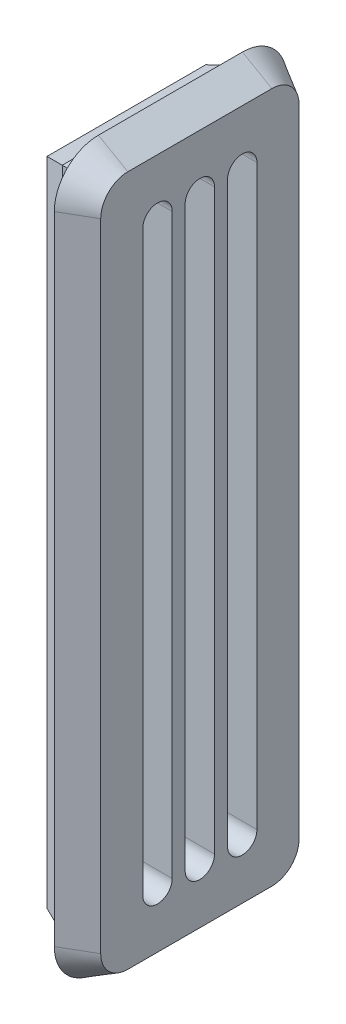
ISO-10303-21;
HEADER;
FILE_DESCRIPTION(('STEP AP214'),'2;1');
FILE_NAME('part.step','',(''),(''),'','','');
FILE_SCHEMA(('AUTOMOTIVE_DESIGN { 1 0 10303 214 1 1 1 1 }'));
ENDSEC;
DATA;
#1=APPLICATION_CONTEXT('core data for automotive mechanical design processes');
#2=APPLICATION_PROTOCOL_DEFINITION('international standard','automotive_design',2000,#1);
#3=PRODUCT_CONTEXT('',#1,'mechanical');
#4=PRODUCT('Part','Part','',(#3));
#5=PRODUCT_RELATED_PRODUCT_CATEGORY('part','',(#4));
#6=PRODUCT_DEFINITION_FORMATION('','',#4);
#7=PRODUCT_DEFINITION_CONTEXT('part definition',#1,'design');
#8=PRODUCT_DEFINITION('design','',#6,#7);
#9=PRODUCT_DEFINITION_SHAPE('','',#8);
#10=(LENGTH_UNIT() NAMED_UNIT(*) SI_UNIT(.MILLI.,.METRE.));
#11=(NAMED_UNIT(*) PLANE_ANGLE_UNIT() SI_UNIT($,.RADIAN.));
#12=(NAMED_UNIT(*) SI_UNIT($,.STERADIAN.) SOLID_ANGLE_UNIT());
#13=UNCERTAINTY_MEASURE_WITH_UNIT(LENGTH_MEASURE(1.E-05),#10,'distance_accuracy_value','');
#14=(GEOMETRIC_REPRESENTATION_CONTEXT(3) GLOBAL_UNCERTAINTY_ASSIGNED_CONTEXT((#13)) GLOBAL_UNIT_ASSIGNED_CONTEXT((#10,
#11,#12)) REPRESENTATION_CONTEXT('',''));
#15=CARTESIAN_POINT('',(0.,0.,0.));
#16=DIRECTION('',(0.,0.,1.));
#17=DIRECTION('',(1.,0.,0.));
#18=AXIS2_PLACEMENT_3D('',#15,#16,#17);
#19=CARTESIAN_POINT('',(0.,0.,0.));
#20=DIRECTION('',(1.,0.,0.));
#21=DIRECTION('',(0.,0.,-1.));
#22=AXIS2_PLACEMENT_3D('',#19,#20,#21);
#23=PLANE('',#22);
#24=DIRECTION('',(0.,1.,0.));
#25=VECTOR('',#24,1.);
#26=CARTESIAN_POINT('',(0.,0.,146.759181516781));
#27=LINE('',#26,#25);
#28=CARTESIAN_POINT('',(0.,22.7611561275582,146.759181516781));
#29=VERTEX_POINT('',#28);
#30=CARTESIAN_POINT('',(0.,67.0611561275582,146.759181516781));
#31=VERTEX_POINT('',#30);
#32=EDGE_CURVE('E461',#29,#31,#27,.T.);
#33=ORIENTED_EDGE('',*,*,#32,.T.);
#34=DIRECTION('',(0.,0.,-1.));
#35=VECTOR('',#34,1.);
#36=CARTESIAN_POINT('',(0.,67.0611561275582,0.));
#37=LINE('',#36,#35);
#38=CARTESIAN_POINT('',(0.,67.0611561275582,135.959181516781));
#39=VERTEX_POINT('',#38);
#40=EDGE_CURVE('E467',#31,#39,#37,.T.);
#41=ORIENTED_EDGE('',*,*,#40,.T.);
#42=DIRECTION('',(0.,-1.,0.));
#43=VECTOR('',#42,1.);
#44=CARTESIAN_POINT('',(0.,0.,135.959181516781));
#45=LINE('',#44,#43);
#46=CARTESIAN_POINT('',(0.,22.7611561275582,135.959181516781));
#47=VERTEX_POINT('',#46);
#48=EDGE_CURVE('E465',#39,#47,#45,.T.);
#49=ORIENTED_EDGE('',*,*,#48,.T.);
#50=DIRECTION('',(0.,0.,1.));
#51=VECTOR('',#50,1.);
#52=CARTESIAN_POINT('',(0.,22.7611561275583,0.));
#53=LINE('',#52,#51);
#54=EDGE_CURVE('E463',#47,#29,#53,.T.);
#55=ORIENTED_EDGE('',*,*,#54,.T.);
#56=EDGE_LOOP('',(#33,#41,#49,#55));
#57=FACE_BOUND('',#56,.T.);
#58=DIRECTION('',(0.,0.,1.));
#59=VECTOR('',#58,1.);
#60=CARTESIAN_POINT('',(0.,66.0611561275582,145.759181516781));
#61=LINE('',#60,#59);
#62=CARTESIAN_POINT('',(0.,66.0611561275582,136.959181516781));
#63=VERTEX_POINT('',#62);
#64=CARTESIAN_POINT('',(0.,66.0611561275582,145.759181516781));
#65=VERTEX_POINT('',#64);
#66=EDGE_CURVE('E366',#63,#65,#61,.T.);
#67=ORIENTED_EDGE('',*,*,#66,.T.);
#68=DIRECTION('',(0.,-1.,0.));
#69=VECTOR('',#68,1.);
#70=CARTESIAN_POINT('',(0.,66.0611561275582,145.759181516781));
#71=LINE('',#70,#69);
#72=CARTESIAN_POINT('',(0.,23.7611561275583,145.759181516781));
#73=VERTEX_POINT('',#72);
#74=EDGE_CURVE('E420',#65,#73,#71,.T.);
#75=ORIENTED_EDGE('',*,*,#74,.T.);
#76=DIRECTION('',(0.,0.,-1.));
#77=VECTOR('',#76,1.);
#78=CARTESIAN_POINT('',(0.,23.7611561275583,145.759181516781));
#79=LINE('',#78,#77);
#80=CARTESIAN_POINT('',(0.,23.7611561275582,136.959181516781));
#81=VERTEX_POINT('',#80);
#82=EDGE_CURVE('E423',#73,#81,#79,.T.);
#83=ORIENTED_EDGE('',*,*,#82,.T.);
#84=DIRECTION('',(0.,1.,0.));
#85=VECTOR('',#84,1.);
#86=CARTESIAN_POINT('',(0.,66.0611561275582,136.959181516781));
#87=LINE('',#86,#85);
#88=EDGE_CURVE('E408',#81,#63,#87,.T.);
#89=ORIENTED_EDGE('',*,*,#88,.T.);
#90=EDGE_LOOP('',(#67,#75,#83,#89));
#91=FACE_BOUND('',#90,.T.);
#92=ADVANCED_FACE('F41',(#57,#91),#23,.F.);
#93=CARTESIAN_POINT('',(3.,67.5611561275582,147.259181516781));
#94=DIRECTION('',(0.,0.,-1.));
#95=DIRECTION('',(-1.,0.,0.));
#96=AXIS2_PLACEMENT_3D('',#93,#94,#95);
#97=PLANE('',#96);
#98=DIRECTION('',(-1.,0.,0.));
#99=VECTOR('',#98,1.);
#100=CARTESIAN_POINT('',(3.,67.5611561275582,147.259181516781));
#101=LINE('',#100,#99);
#102=CARTESIAN_POINT('',(3.,67.5611561275582,147.259181516781));
#103=VERTEX_POINT('',#102);
#104=CARTESIAN_POINT('',(1.53884176858762,67.5611561275582,147.259181516781));
#105=VERTEX_POINT('',#104);
#106=EDGE_CURVE('E449',#103,#105,#101,.T.);
#107=ORIENTED_EDGE('',*,*,#106,.T.);
#108=DIRECTION('',(0.,-1.,0.));
#109=VECTOR('',#108,1.);
#110=CARTESIAN_POINT('',(1.53884176858762,67.5611561275582,147.259181516781));
#111=LINE('',#110,#109);
#112=CARTESIAN_POINT('',(1.53884176858762,22.2611561275582,147.259181516781));
#113=VERTEX_POINT('',#112);
#114=EDGE_CURVE('E11',#105,#113,#111,.T.);
#115=ORIENTED_EDGE('',*,*,#114,.T.);
#116=DIRECTION('',(-1.,0.,0.));
#117=VECTOR('',#116,1.);
#118=CARTESIAN_POINT('',(3.,22.2611561275582,147.259181516781));
#119=LINE('',#118,#117);
#120=CARTESIAN_POINT('',(3.,22.2611561275582,147.259181516781));
#121=VERTEX_POINT('',#120);
#122=EDGE_CURVE('E456',#121,#113,#119,.T.);
#123=ORIENTED_EDGE('',*,*,#122,.F.);
#124=DIRECTION('',(0.,-1.,0.));
#125=VECTOR('',#124,1.);
#126=CARTESIAN_POINT('',(3.,67.5611561275582,147.259181516781));
#127=LINE('',#126,#125);
#128=EDGE_CURVE('E437',#103,#121,#127,.T.);
#129=ORIENTED_EDGE('',*,*,#128,.F.);
#130=EDGE_LOOP('',(#107,#115,#123,#129));
#131=FACE_BOUND('',#130,.T.);
#132=ADVANCED_FACE('F502',(#131),#97,.F.);
#133=CARTESIAN_POINT('',(3.,22.2611561275582,147.259181516781));
#134=DIRECTION('',(0.,1.,0.));
#135=DIRECTION('',(0.,0.,1.));
#136=AXIS2_PLACEMENT_3D('',#133,#134,#135);
#137=PLANE('',#136);
#138=ORIENTED_EDGE('',*,*,#122,.T.);
#139=DIRECTION('',(0.,0.,-1.));
#140=VECTOR('',#139,1.);
#141=CARTESIAN_POINT('',(1.53884176858762,22.2611561275582,147.259181516781));
#142=LINE('',#141,#140);
#143=CARTESIAN_POINT('',(1.53884176858762,22.2611561275582,135.459181516781));
#144=VERTEX_POINT('',#143);
#145=EDGE_CURVE('E51',#113,#144,#142,.T.);
#146=ORIENTED_EDGE('',*,*,#145,.T.);
#147=DIRECTION('',(-1.,0.,0.));
#148=VECTOR('',#147,1.);
#149=CARTESIAN_POINT('',(3.,22.2611561275582,135.459181516781));
#150=LINE('',#149,#148);
#151=CARTESIAN_POINT('',(3.,22.2611561275582,135.459181516781));
#152=VERTEX_POINT('',#151);
#153=EDGE_CURVE('E454',#152,#144,#150,.T.);
#154=ORIENTED_EDGE('',*,*,#153,.F.);
#155=DIRECTION('',(0.,0.,-1.));
#156=VECTOR('',#155,1.);
#157=CARTESIAN_POINT('',(3.,22.2611561275582,147.259181516781));
#158=LINE('',#157,#156);
#159=EDGE_CURVE('E440',#121,#152,#158,.T.);
#160=ORIENTED_EDGE('',*,*,#159,.F.);
#161=EDGE_LOOP('',(#138,#146,#154,#160));
#162=FACE_BOUND('',#161,.T.);
#163=ADVANCED_FACE('F509',(#162),#137,.F.);
#164=CARTESIAN_POINT('',(3.,67.5611561275582,135.459181516781));
#165=DIRECTION('',(0.,0.,1.));
#166=DIRECTION('',(1.,0.,0.));
#167=AXIS2_PLACEMENT_3D('',#164,#165,#166);
#168=PLANE('',#167);
#169=ORIENTED_EDGE('',*,*,#153,.T.);
#170=DIRECTION('',(0.,1.,0.));
#171=VECTOR('',#170,1.);
#172=CARTESIAN_POINT('',(1.53884176858762,67.5611561275582,135.459181516781));
#173=LINE('',#172,#171);
#174=CARTESIAN_POINT('',(1.53884176858762,67.5611561275582,135.459181516781));
#175=VERTEX_POINT('',#174);
#176=EDGE_CURVE('E470',#144,#175,#173,.T.);
#177=ORIENTED_EDGE('',*,*,#176,.T.);
#178=DIRECTION('',(-1.,0.,0.));
#179=VECTOR('',#178,1.);
#180=CARTESIAN_POINT('',(3.,67.5611561275582,135.459181516781));
#181=LINE('',#180,#179);
#182=CARTESIAN_POINT('',(3.,67.5611561275582,135.459181516781));
#183=VERTEX_POINT('',#182);
#184=EDGE_CURVE('E451',#183,#175,#181,.T.);
#185=ORIENTED_EDGE('',*,*,#184,.F.);
#186=DIRECTION('',(0.,1.,0.));
#187=VECTOR('',#186,1.);
#188=CARTESIAN_POINT('',(3.,67.5611561275582,135.459181516781));
#189=LINE('',#188,#187);
#190=EDGE_CURVE('E443',#152,#183,#189,.T.);
#191=ORIENTED_EDGE('',*,*,#190,.F.);
#192=EDGE_LOOP('',(#169,#177,#185,#191));
#193=FACE_BOUND('',#192,.T.);
#194=ADVANCED_FACE('F508',(#193),#168,.F.);
#195=CARTESIAN_POINT('',(3.,67.5611561275582,147.259181516781));
#196=DIRECTION('',(0.,-1.,0.));
#197=DIRECTION('',(0.,0.,-1.));
#198=AXIS2_PLACEMENT_3D('',#195,#196,#197);
#199=PLANE('',#198);
#200=ORIENTED_EDGE('',*,*,#184,.T.);
#201=DIRECTION('',(0.,0.,1.));
#202=VECTOR('',#201,1.);
#203=CARTESIAN_POINT('',(1.53884176858762,67.5611561275582,147.259181516781));
#204=LINE('',#203,#202);
#205=EDGE_CURVE('E458',#175,#105,#204,.T.);
#206=ORIENTED_EDGE('',*,*,#205,.T.);
#207=ORIENTED_EDGE('',*,*,#106,.F.);
#208=DIRECTION('',(0.,0.,1.));
#209=VECTOR('',#208,1.);
#210=CARTESIAN_POINT('',(3.,67.5611561275582,147.259181516781));
#211=LINE('',#210,#209);
#212=EDGE_CURVE('E446',#183,#103,#211,.T.);
#213=ORIENTED_EDGE('',*,*,#212,.F.);
#214=EDGE_LOOP('',(#200,#206,#207,#213));
#215=FACE_BOUND('',#214,.T.);
#216=ADVANCED_FACE('F500',(#215),#199,.F.);
#217=CARTESIAN_POINT('',(3.,66.0611561275582,145.759181516781));
#218=DIRECTION('',(0.,-1.,0.));
#219=DIRECTION('',(0.,0.,-1.));
#220=AXIS2_PLACEMENT_3D('',#217,#218,#219);
#221=PLANE('',#220);
#222=ORIENTED_EDGE('',*,*,#66,.F.);
#223=DIRECTION('',(-1.,0.,0.));
#224=VECTOR('',#223,1.);
#225=CARTESIAN_POINT('',(3.,66.0611561275582,136.959181516781));
#226=LINE('',#225,#224);
#227=CARTESIAN_POINT('',(3.,66.0611561275582,136.959181516781));
#228=VERTEX_POINT('',#227);
#229=EDGE_CURVE('E417',#228,#63,#226,.T.);
#230=ORIENTED_EDGE('',*,*,#229,.F.);
#231=DIRECTION('',(0.,0.,1.));
#232=VECTOR('',#231,1.);
#233=CARTESIAN_POINT('',(3.,66.0611561275582,145.759181516781));
#234=LINE('',#233,#232);
#235=CARTESIAN_POINT('',(3.,66.0611561275582,145.759181516781));
#236=VERTEX_POINT('',#235);
#237=EDGE_CURVE('E404',#228,#236,#234,.T.);
#238=ORIENTED_EDGE('',*,*,#237,.T.);
#239=DIRECTION('',(-1.,0.,0.));
#240=VECTOR('',#239,1.);
#241=CARTESIAN_POINT('',(3.,66.0611561275582,145.759181516781));
#242=LINE('',#241,#240);
#243=EDGE_CURVE('E434',#236,#65,#242,.T.);
#244=ORIENTED_EDGE('',*,*,#243,.T.);
#245=EDGE_LOOP('',(#222,#230,#238,#244));
#246=FACE_BOUND('',#245,.T.);
#247=ADVANCED_FACE('F524',(#246),#221,.T.);
#248=CARTESIAN_POINT('',(3.,66.0611561275582,145.759181516781));
#249=DIRECTION('',(0.,0.,-1.));
#250=DIRECTION('',(-1.,0.,0.));
#251=AXIS2_PLACEMENT_3D('',#248,#249,#250);
#252=PLANE('',#251);
#253=ORIENTED_EDGE('',*,*,#74,.F.);
#254=ORIENTED_EDGE('',*,*,#243,.F.);
#255=DIRECTION('',(0.,-1.,0.));
#256=VECTOR('',#255,1.);
#257=CARTESIAN_POINT('',(3.,66.0611561275582,145.759181516781));
#258=LINE('',#257,#256);
#259=CARTESIAN_POINT('',(3.,23.7611561275583,145.759181516781));
#260=VERTEX_POINT('',#259);
#261=EDGE_CURVE('E407',#236,#260,#258,.T.);
#262=ORIENTED_EDGE('',*,*,#261,.T.);
#263=DIRECTION('',(-1.,0.,0.));
#264=VECTOR('',#263,1.);
#265=CARTESIAN_POINT('',(3.,23.7611561275583,145.759181516781));
#266=LINE('',#265,#264);
#267=EDGE_CURVE('E432',#260,#73,#266,.T.);
#268=ORIENTED_EDGE('',*,*,#267,.T.);
#269=EDGE_LOOP('',(#253,#254,#262,#268));
#270=FACE_BOUND('',#269,.T.);
#271=ADVANCED_FACE('F530',(#270),#252,.T.);
#272=CARTESIAN_POINT('',(3.,23.7611561275583,145.759181516781));
#273=DIRECTION('',(0.,1.,0.));
#274=DIRECTION('',(0.,0.,1.));
#275=AXIS2_PLACEMENT_3D('',#272,#273,#274);
#276=PLANE('',#275);
#277=ORIENTED_EDGE('',*,*,#82,.F.);
#278=ORIENTED_EDGE('',*,*,#267,.F.);
#279=DIRECTION('',(0.,0.,-1.));
#280=VECTOR('',#279,1.);
#281=CARTESIAN_POINT('',(3.,23.7611561275583,145.759181516781));
#282=LINE('',#281,#280);
#283=CARTESIAN_POINT('',(3.,23.7611561275582,136.959181516781));
#284=VERTEX_POINT('',#283);
#285=EDGE_CURVE('E411',#260,#284,#282,.T.);
#286=ORIENTED_EDGE('',*,*,#285,.T.);
#287=DIRECTION('',(-1.,0.,0.));
#288=VECTOR('',#287,1.);
#289=CARTESIAN_POINT('',(3.,23.7611561275582,136.959181516781));
#290=LINE('',#289,#288);
#291=EDGE_CURVE('E430',#284,#81,#290,.T.);
#292=ORIENTED_EDGE('',*,*,#291,.T.);
#293=EDGE_LOOP('',(#277,#278,#286,#292));
#294=FACE_BOUND('',#293,.T.);
#295=ADVANCED_FACE('F535',(#294),#276,.T.);
#296=CARTESIAN_POINT('',(3.,66.0611561275582,136.959181516781));
#297=DIRECTION('',(0.,0.,1.));
#298=DIRECTION('',(1.,0.,0.));
#299=AXIS2_PLACEMENT_3D('',#296,#297,#298);
#300=PLANE('',#299);
#301=ORIENTED_EDGE('',*,*,#88,.F.);
#302=ORIENTED_EDGE('',*,*,#291,.F.);
#303=DIRECTION('',(0.,1.,0.));
#304=VECTOR('',#303,1.);
#305=CARTESIAN_POINT('',(3.,66.0611561275582,136.959181516781));
#306=LINE('',#305,#304);
#307=EDGE_CURVE('E414',#284,#228,#306,.T.);
#308=ORIENTED_EDGE('',*,*,#307,.T.);
#309=ORIENTED_EDGE('',*,*,#229,.T.);
#310=EDGE_LOOP('',(#301,#302,#308,#309));
#311=FACE_BOUND('',#310,.T.);
#312=ADVANCED_FACE('F541',(#311),#300,.T.);
#313=CARTESIAN_POINT('',(3.,66.5611561275582,136.459181516781));
#314=DIRECTION('',(-1.,0.,0.));
#315=DIRECTION('',(0.,0.,1.));
#316=AXIS2_PLACEMENT_3D('',#313,#314,#315);
#317=PLANE('',#316);
#318=CARTESIAN_POINT('',(3.,64.5611561275582,141.359181516781));
#319=DIRECTION('',(-1.,0.,0.));
#320=DIRECTION('',(0.,0.,1.));
#321=AXIS2_PLACEMENT_3D('',#318,#319,#320);
#322=CIRCLE('',#321,1.00000000000003);
#323=CARTESIAN_POINT('',(3.,64.5611561275582,142.359181516781));
#324=VERTEX_POINT('',#323);
#325=CARTESIAN_POINT('',(3.,64.5611561275582,140.359181516781));
#326=VERTEX_POINT('',#325);
#327=EDGE_CURVE('E305',#324,#326,#322,.T.);
#328=ORIENTED_EDGE('',*,*,#327,.F.);
#329=DIRECTION('',(0.,1.,0.));
#330=VECTOR('',#329,1.);
#331=CARTESIAN_POINT('',(3.,64.5611561275582,142.359181516781));
#332=LINE('',#331,#330);
#333=CARTESIAN_POINT('',(3.,25.2611561275582,142.359181516781));
#334=VERTEX_POINT('',#333);
#335=EDGE_CURVE('E291',#334,#324,#332,.T.);
#336=ORIENTED_EDGE('',*,*,#335,.F.);
#337=CARTESIAN_POINT('',(3.,25.2611561275582,141.359181516781));
#338=DIRECTION('',(-1.,0.,0.));
#339=DIRECTION('',(0.,0.,1.));
#340=AXIS2_PLACEMENT_3D('',#337,#338,#339);
#341=CIRCLE('',#340,1.00000000000003);
#342=CARTESIAN_POINT('',(3.,25.2611561275582,140.359181516781));
#343=VERTEX_POINT('',#342);
#344=EDGE_CURVE('E300',#343,#334,#341,.T.);
#345=ORIENTED_EDGE('',*,*,#344,.F.);
#346=DIRECTION('',(0.,-1.,0.));
#347=VECTOR('',#346,1.);
#348=CARTESIAN_POINT('',(3.,64.5611561275582,140.359181516781));
#349=LINE('',#348,#347);
#350=EDGE_CURVE('E302',#326,#343,#349,.T.);
#351=ORIENTED_EDGE('',*,*,#350,.F.);
#352=EDGE_LOOP('',(#328,#336,#345,#351));
#353=FACE_BOUND('',#352,.T.);
#354=CARTESIAN_POINT('',(3.,64.5611561275582,144.241468337996));
#355=DIRECTION('',(-1.,0.,0.));
#356=DIRECTION('',(0.,0.,1.));
#357=AXIS2_PLACEMENT_3D('',#354,#355,#356);
#358=CIRCLE('',#357,0.999999999999973);
#359=CARTESIAN_POINT('',(3.,64.5611561275582,145.241468337996));
#360=VERTEX_POINT('',#359);
#361=CARTESIAN_POINT('',(3.,64.5611561275582,143.241468337996));
#362=VERTEX_POINT('',#361);
#363=EDGE_CURVE('E247',#360,#362,#358,.T.);
#364=ORIENTED_EDGE('',*,*,#363,.F.);
#365=DIRECTION('',(0.,1.,0.));
#366=VECTOR('',#365,1.);
#367=CARTESIAN_POINT('',(3.,64.5611561275582,145.241468337996));
#368=LINE('',#367,#366);
#369=CARTESIAN_POINT('',(3.,25.2611561275582,145.241468337996));
#370=VERTEX_POINT('',#369);
#371=EDGE_CURVE('E252',#370,#360,#368,.T.);
#372=ORIENTED_EDGE('',*,*,#371,.F.);
#373=CARTESIAN_POINT('',(3.,25.2611561275582,144.241468337996));
#374=DIRECTION('',(-1.,0.,0.));
#375=DIRECTION('',(0.,0.,1.));
#376=AXIS2_PLACEMENT_3D('',#373,#374,#375);
#377=CIRCLE('',#376,1.00000000000003);
#378=CARTESIAN_POINT('',(3.,25.2611561275582,143.241468337996));
#379=VERTEX_POINT('',#378);
#380=EDGE_CURVE('E275',#379,#370,#377,.T.);
#381=ORIENTED_EDGE('',*,*,#380,.F.);
#382=DIRECTION('',(0.,-1.,0.));
#383=VECTOR('',#382,1.);
#384=CARTESIAN_POINT('',(3.,64.5611561275582,143.241468337996));
#385=LINE('',#384,#383);
#386=EDGE_CURVE('E268',#362,#379,#385,.T.);
#387=ORIENTED_EDGE('',*,*,#386,.F.);
#388=EDGE_LOOP('',(#364,#372,#381,#387));
#389=FACE_BOUND('',#388,.T.);
#390=CARTESIAN_POINT('',(3.,64.5611561275582,138.476894695567));
#391=DIRECTION('',(-1.,0.,0.));
#392=DIRECTION('',(0.,0.,1.));
#393=AXIS2_PLACEMENT_3D('',#390,#391,#392);
#394=CIRCLE('',#393,0.999999999999973);
#395=CARTESIAN_POINT('',(3.,64.5611561275582,139.476894695567));
#396=VERTEX_POINT('',#395);
#397=CARTESIAN_POINT('',(3.,64.5611561275582,137.476894695567));
#398=VERTEX_POINT('',#397);
#399=EDGE_CURVE('E337',#396,#398,#394,.T.);
#400=ORIENTED_EDGE('',*,*,#399,.F.);
#401=DIRECTION('',(0.,1.,0.));
#402=VECTOR('',#401,1.);
#403=CARTESIAN_POINT('',(3.,64.5611561275582,139.476894695567));
#404=LINE('',#403,#402);
#405=CARTESIAN_POINT('',(3.,25.2611561275582,139.476894695567));
#406=VERTEX_POINT('',#405);
#407=EDGE_CURVE('E323',#406,#396,#404,.T.);
#408=ORIENTED_EDGE('',*,*,#407,.F.);
#409=CARTESIAN_POINT('',(3.,25.2611561275582,138.476894695567));
#410=DIRECTION('',(-1.,0.,0.));
#411=DIRECTION('',(0.,0.,1.));
#412=AXIS2_PLACEMENT_3D('',#409,#410,#411);
#413=CIRCLE('',#412,0.999999999999973);
#414=CARTESIAN_POINT('',(3.,25.2611561275582,137.476894695567));
#415=VERTEX_POINT('',#414);
#416=EDGE_CURVE('E331',#415,#406,#413,.T.);
#417=ORIENTED_EDGE('',*,*,#416,.F.);
#418=DIRECTION('',(0.,-1.,0.));
#419=VECTOR('',#418,1.);
#420=CARTESIAN_POINT('',(3.,64.5611561275582,137.476894695567));
#421=LINE('',#420,#419);
#422=EDGE_CURVE('E334',#398,#415,#421,.T.);
#423=ORIENTED_EDGE('',*,*,#422,.F.);
#424=EDGE_LOOP('',(#400,#408,#417,#423));
#425=FACE_BOUND('',#424,.T.);
#426=ORIENTED_EDGE('',*,*,#261,.F.);
#427=ORIENTED_EDGE('',*,*,#237,.F.);
#428=ORIENTED_EDGE('',*,*,#307,.F.);
#429=ORIENTED_EDGE('',*,*,#285,.F.);
#430=EDGE_LOOP('',(#426,#427,#428,#429));
#431=FACE_BOUND('',#430,.T.);
#432=ADVANCED_FACE('F547',(#353,#389,#425,#431),#317,.T.);
#433=CARTESIAN_POINT('',(3.,66.5611561275582,136.459181516781));
#434=DIRECTION('',(-1.,0.,0.));
#435=DIRECTION('',(0.,0.,1.));
#436=AXIS2_PLACEMENT_3D('',#433,#434,#435);
#437=CONICAL_SURFACE('',#436,3.,0.5235987755983);
#438=CARTESIAN_POINT('',(3.,66.5611561275582,136.459181516781));
#439=DIRECTION('',(1.,0.,0.));
#440=DIRECTION('',(0.,0.,1.));
#441=AXIS2_PLACEMENT_3D('',#438,#439,#440);
#442=CIRCLE('',#441,3.);
#443=CARTESIAN_POINT('',(3.,66.5611561275582,133.459181516781));
#444=VERTEX_POINT('',#443);
#445=CARTESIAN_POINT('',(3.,69.5611561275582,136.459181516781));
#446=VERTEX_POINT('',#445);
#447=EDGE_CURVE('E260',#444,#446,#442,.T.);
#448=ORIENTED_EDGE('',*,*,#447,.T.);
#449=DIRECTION('',(-0.866025403784438,0.500000000000001,0.));
#450=VECTOR('',#449,1.);
#451=CARTESIAN_POINT('',(3.,69.5611561275582,136.459181516781));
#452=LINE('',#451,#450);
#453=CARTESIAN_POINT('',(5.,68.406455589179,136.459181516781));
#454=VERTEX_POINT('',#453);
#455=EDGE_CURVE('E363',#454,#446,#452,.T.);
#456=ORIENTED_EDGE('',*,*,#455,.F.);
#457=CARTESIAN_POINT('',(5.,66.5611561275582,136.459181516781));
#458=DIRECTION('',(-1.,0.,0.));
#459=DIRECTION('',(0.,0.,1.));
#460=AXIS2_PLACEMENT_3D('',#457,#458,#459);
#461=CIRCLE('',#460,1.84529946162075);
#462=CARTESIAN_POINT('',(5.,66.5611561275582,134.613882055161));
#463=VERTEX_POINT('',#462);
#464=EDGE_CURVE('E362',#463,#454,#461,.F.);
#465=ORIENTED_EDGE('',*,*,#464,.F.);
#466=DIRECTION('',(-0.866025403784438,0.,-0.500000000000001));
#467=VECTOR('',#466,1.);
#468=CARTESIAN_POINT('',(3.,66.5611561275582,133.459181516781));
#469=LINE('',#468,#467);
#470=EDGE_CURVE('E368',#463,#444,#469,.T.);
#471=ORIENTED_EDGE('',*,*,#470,.T.);
#472=EDGE_LOOP('',(#448,#456,#465,#471));
#473=FACE_BOUND('',#472,.T.);
#474=ADVANCED_FACE('F549',(#473),#437,.T.);
#475=CARTESIAN_POINT('',(3.,69.5611561275582,136.459181516781));
#476=DIRECTION('',(0.500000000000001,0.866025403784438,0.));
#477=DIRECTION('',(-0.866025403784438,0.500000000000001,0.));
#478=AXIS2_PLACEMENT_3D('',#475,#476,#477);
#479=PLANE('',#478);
#480=DIRECTION('',(0.,0.,1.));
#481=VECTOR('',#480,1.);
#482=CARTESIAN_POINT('',(3.,69.5611561275582,136.459181516781));
#483=LINE('',#482,#481);
#484=CARTESIAN_POINT('',(3.,69.5611561275582,146.259181516781));
#485=VERTEX_POINT('',#484);
#486=EDGE_CURVE('E348',#446,#485,#483,.T.);
#487=ORIENTED_EDGE('',*,*,#486,.T.);
#488=DIRECTION('',(-0.866025403784438,0.500000000000001,0.));
#489=VECTOR('',#488,1.);
#490=CARTESIAN_POINT('',(3.,69.5611561275582,146.259181516781));
#491=LINE('',#490,#489);
#492=CARTESIAN_POINT('',(5.,68.406455589179,146.259181516781));
#493=VERTEX_POINT('',#492);
#494=EDGE_CURVE('E367',#493,#485,#491,.T.);
#495=ORIENTED_EDGE('',*,*,#494,.F.);
#496=DIRECTION('',(0.,0.,-1.));
#497=VECTOR('',#496,1.);
#498=CARTESIAN_POINT('',(5.,68.406455589179,136.459181516781));
#499=LINE('',#498,#497);
#500=EDGE_CURVE('E391',#454,#493,#499,.F.);
#501=ORIENTED_EDGE('',*,*,#500,.F.);
#502=ORIENTED_EDGE('',*,*,#455,.T.);
#503=EDGE_LOOP('',(#487,#495,#501,#502));
#504=FACE_BOUND('',#503,.T.);
#505=ADVANCED_FACE('F556',(#504),#479,.T.);
#506=CARTESIAN_POINT('',(3.,66.5611561275582,146.259181516781));
#507=DIRECTION('',(-1.,0.,0.));
#508=DIRECTION('',(0.,0.,1.));
#509=AXIS2_PLACEMENT_3D('',#506,#507,#508);
#510=CONICAL_SURFACE('',#509,3.,0.5235987755983);
#511=CARTESIAN_POINT('',(3.,66.5611561275582,146.259181516781));
#512=DIRECTION('',(1.,0.,0.));
#513=DIRECTION('',(0.,0.,1.));
#514=AXIS2_PLACEMENT_3D('',#511,#512,#513);
#515=CIRCLE('',#514,3.);
#516=CARTESIAN_POINT('',(3.,66.5611561275582,149.259181516781));
#517=VERTEX_POINT('',#516);
#518=EDGE_CURVE('E350',#485,#517,#515,.T.);
#519=ORIENTED_EDGE('',*,*,#518,.T.);
#520=DIRECTION('',(-0.866025403784438,0.,0.500000000000001));
#521=VECTOR('',#520,1.);
#522=CARTESIAN_POINT('',(3.,66.5611561275582,149.259181516781));
#523=LINE('',#522,#521);
#524=CARTESIAN_POINT('',(5.,66.5611561275582,148.104480978402));
#525=VERTEX_POINT('',#524);
#526=EDGE_CURVE('E384',#525,#517,#523,.T.);
#527=ORIENTED_EDGE('',*,*,#526,.F.);
#528=CARTESIAN_POINT('',(5.,66.5611561275582,146.259181516781));
#529=DIRECTION('',(-1.,0.,0.));
#530=DIRECTION('',(0.,0.,1.));
#531=AXIS2_PLACEMENT_3D('',#528,#529,#530);
#532=CIRCLE('',#531,1.84529946162075);
#533=EDGE_CURVE('E393',#493,#525,#532,.F.);
#534=ORIENTED_EDGE('',*,*,#533,.F.);
#535=ORIENTED_EDGE('',*,*,#494,.T.);
#536=EDGE_LOOP('',(#519,#527,#534,#535));
#537=FACE_BOUND('',#536,.T.);
#538=ADVANCED_FACE('F645',(#537),#510,.T.);
#539=CARTESIAN_POINT('',(3.,66.5611561275582,149.259181516781));
#540=DIRECTION('',(0.500000000000001,0.,0.866025403784438));
#541=DIRECTION('',(0.866025403784438,0.,-0.500000000000001));
#542=AXIS2_PLACEMENT_3D('',#539,#540,#541);
#543=PLANE('',#542);
#544=DIRECTION('',(0.,-1.,0.));
#545=VECTOR('',#544,1.);
#546=CARTESIAN_POINT('',(3.,66.5611561275582,149.259181516781));
#547=LINE('',#546,#545);
#548=CARTESIAN_POINT('',(3.,23.2611561275583,149.259181516781));
#549=VERTEX_POINT('',#548);
#550=EDGE_CURVE('E352',#517,#549,#547,.T.);
#551=ORIENTED_EDGE('',*,*,#550,.T.);
#552=DIRECTION('',(-0.866025403784438,0.,0.500000000000001));
#553=VECTOR('',#552,1.);
#554=CARTESIAN_POINT('',(3.,23.2611561275583,149.259181516781));
#555=LINE('',#554,#553);
#556=CARTESIAN_POINT('',(5.,23.2611561275583,148.104480978402));
#557=VERTEX_POINT('',#556);
#558=EDGE_CURVE('E381',#557,#549,#555,.T.);
#559=ORIENTED_EDGE('',*,*,#558,.F.);
#560=DIRECTION('',(0.,1.,0.));
#561=VECTOR('',#560,1.);
#562=CARTESIAN_POINT('',(5.,66.5611561275582,148.104480978402));
#563=LINE('',#562,#561);
#564=EDGE_CURVE('E395',#525,#557,#563,.F.);
#565=ORIENTED_EDGE('',*,*,#564,.F.);
#566=ORIENTED_EDGE('',*,*,#526,.T.);
#567=EDGE_LOOP('',(#551,#559,#565,#566));
#568=FACE_BOUND('',#567,.T.);
#569=ADVANCED_FACE('F651',(#568),#543,.T.);
#570=CARTESIAN_POINT('',(3.,23.2611561275582,146.259181516781));
#571=DIRECTION('',(-1.,0.,0.));
#572=DIRECTION('',(0.,0.,1.));
#573=AXIS2_PLACEMENT_3D('',#570,#571,#572);
#574=CONICAL_SURFACE('',#573,3.,0.5235987755983);
#575=CARTESIAN_POINT('',(3.,23.2611561275582,146.259181516781));
#576=DIRECTION('',(1.,0.,0.));
#577=DIRECTION('',(0.,0.,1.));
#578=AXIS2_PLACEMENT_3D('',#575,#576,#577);
#579=CIRCLE('',#578,3.);
#580=CARTESIAN_POINT('',(3.,20.2611561275582,146.259181516781));
#581=VERTEX_POINT('',#580);
#582=EDGE_CURVE('E354',#549,#581,#579,.T.);
#583=ORIENTED_EDGE('',*,*,#582,.T.);
#584=DIRECTION('',(-0.866025403784438,-0.500000000000001,0.));
#585=VECTOR('',#584,1.);
#586=CARTESIAN_POINT('',(3.,20.2611561275582,146.259181516781));
#587=LINE('',#586,#585);
#588=CARTESIAN_POINT('',(5.,21.4158566659375,146.259181516781));
#589=VERTEX_POINT('',#588);
#590=EDGE_CURVE('E378',#589,#581,#587,.T.);
#591=ORIENTED_EDGE('',*,*,#590,.F.);
#592=CARTESIAN_POINT('',(5.,23.2611561275582,146.259181516781));
#593=DIRECTION('',(-1.,0.,0.));
#594=DIRECTION('',(0.,0.,1.));
#595=AXIS2_PLACEMENT_3D('',#592,#593,#594);
#596=CIRCLE('',#595,1.84529946162075);
#597=EDGE_CURVE('E397',#557,#589,#596,.F.);
#598=ORIENTED_EDGE('',*,*,#597,.F.);
#599=ORIENTED_EDGE('',*,*,#558,.T.);
#600=EDGE_LOOP('',(#583,#591,#598,#599));
#601=FACE_BOUND('',#600,.T.);
#602=ADVANCED_FACE('F655',(#601),#574,.T.);
#603=CARTESIAN_POINT('',(3.,20.2611561275582,146.259181516781));
#604=DIRECTION('',(0.500000000000001,-0.866025403784438,0.));
#605=DIRECTION('',(0.866025403784438,0.500000000000001,0.));
#606=AXIS2_PLACEMENT_3D('',#603,#604,#605);
#607=PLANE('',#606);
#608=DIRECTION('',(0.,0.,-1.));
#609=VECTOR('',#608,1.);
#610=CARTESIAN_POINT('',(3.,20.2611561275582,146.259181516781));
#611=LINE('',#610,#609);
#612=CARTESIAN_POINT('',(3.,20.2611561275582,136.459181516781));
#613=VERTEX_POINT('',#612);
#614=EDGE_CURVE('E356',#581,#613,#611,.T.);
#615=ORIENTED_EDGE('',*,*,#614,.T.);
#616=DIRECTION('',(-0.866025403784438,-0.500000000000001,0.));
#617=VECTOR('',#616,1.);
#618=CARTESIAN_POINT('',(3.,20.2611561275582,136.459181516781));
#619=LINE('',#618,#617);
#620=CARTESIAN_POINT('',(5.,21.4158566659375,136.459181516781));
#621=VERTEX_POINT('',#620);
#622=EDGE_CURVE('E375',#621,#613,#619,.T.);
#623=ORIENTED_EDGE('',*,*,#622,.F.);
#624=DIRECTION('',(0.,0.,1.));
#625=VECTOR('',#624,1.);
#626=CARTESIAN_POINT('',(5.,21.4158566659375,136.459181516781));
#627=LINE('',#626,#625);
#628=EDGE_CURVE('E399',#589,#621,#627,.F.);
#629=ORIENTED_EDGE('',*,*,#628,.F.);
#630=ORIENTED_EDGE('',*,*,#590,.T.);
#631=EDGE_LOOP('',(#615,#623,#629,#630));
#632=FACE_BOUND('',#631,.T.);
#633=ADVANCED_FACE('F660',(#632),#607,.T.);
#634=CARTESIAN_POINT('',(3.,23.2611561275582,136.459181516781));
#635=DIRECTION('',(-1.,0.,0.));
#636=DIRECTION('',(0.,0.,-1.));
#637=AXIS2_PLACEMENT_3D('',#634,#635,#636);
#638=CONICAL_SURFACE('',#637,3.,0.5235987755983);
#639=CARTESIAN_POINT('',(3.,23.2611561275582,136.459181516781));
#640=DIRECTION('',(1.,0.,0.));
#641=DIRECTION('',(0.,0.,-1.));
#642=AXIS2_PLACEMENT_3D('',#639,#640,#641);
#643=CIRCLE('',#642,3.);
#644=CARTESIAN_POINT('',(3.,23.2611561275582,133.459181516781));
#645=VERTEX_POINT('',#644);
#646=EDGE_CURVE('E358',#613,#645,#643,.T.);
#647=ORIENTED_EDGE('',*,*,#646,.T.);
#648=DIRECTION('',(-0.866025403784438,0.,-0.500000000000001));
#649=VECTOR('',#648,1.);
#650=CARTESIAN_POINT('',(3.,23.2611561275582,133.459181516781));
#651=LINE('',#650,#649);
#652=CARTESIAN_POINT('',(5.,23.2611561275582,134.613882055161));
#653=VERTEX_POINT('',#652);
#654=EDGE_CURVE('E371',#653,#645,#651,.T.);
#655=ORIENTED_EDGE('',*,*,#654,.F.);
#656=CARTESIAN_POINT('',(5.,23.2611561275582,136.459181516781));
#657=DIRECTION('',(-1.,0.,0.));
#658=DIRECTION('',(0.,0.,1.));
#659=AXIS2_PLACEMENT_3D('',#656,#657,#658);
#660=CIRCLE('',#659,1.84529946162075);
#661=EDGE_CURVE('E401',#621,#653,#660,.F.);
#662=ORIENTED_EDGE('',*,*,#661,.F.);
#663=ORIENTED_EDGE('',*,*,#622,.T.);
#664=EDGE_LOOP('',(#647,#655,#662,#663));
#665=FACE_BOUND('',#664,.T.);
#666=ADVANCED_FACE('F576',(#665),#638,.T.);
#667=CARTESIAN_POINT('',(3.,23.2611561275583,133.459181516781));
#668=DIRECTION('',(0.500000000000001,0.,-0.866025403784438));
#669=DIRECTION('',(-0.866025403784438,0.,-0.500000000000001));
#670=AXIS2_PLACEMENT_3D('',#667,#668,#669);
#671=PLANE('',#670);
#672=DIRECTION('',(0.,1.,0.));
#673=VECTOR('',#672,1.);
#674=CARTESIAN_POINT('',(3.,23.2611561275583,133.459181516781));
#675=LINE('',#674,#673);
#676=EDGE_CURVE('E360',#645,#444,#675,.T.);
#677=ORIENTED_EDGE('',*,*,#676,.T.);
#678=ORIENTED_EDGE('',*,*,#470,.F.);
#679=DIRECTION('',(0.,-1.,0.));
#680=VECTOR('',#679,1.);
#681=CARTESIAN_POINT('',(5.,66.5611561275582,134.613882055161));
#682=LINE('',#681,#680);
#683=EDGE_CURVE('E372',#653,#463,#682,.F.);
#684=ORIENTED_EDGE('',*,*,#683,.F.);
#685=ORIENTED_EDGE('',*,*,#654,.T.);
#686=EDGE_LOOP('',(#677,#678,#684,#685));
#687=FACE_BOUND('',#686,.T.);
#688=ADVANCED_FACE('F572',(#687),#671,.T.);
#689=CARTESIAN_POINT('',(5.,66.5611561275582,136.459181516781));
#690=DIRECTION('',(-1.,0.,0.));
#691=DIRECTION('',(0.,0.,1.));
#692=AXIS2_PLACEMENT_3D('',#689,#690,#691);
#693=PLANE('',#692);
#694=DIRECTION('',(0.,-1.,0.));
#695=VECTOR('',#694,1.);
#696=CARTESIAN_POINT('',(5.,64.5611561275582,145.241468337996));
#697=LINE('',#696,#695);
#698=CARTESIAN_POINT('',(5.,64.5611561275582,145.241468337996));
#699=VERTEX_POINT('',#698);
#700=CARTESIAN_POINT('',(5.,25.2611561275582,145.241468337996));
#701=VERTEX_POINT('',#700);
#702=EDGE_CURVE('E266',#699,#701,#697,.T.);
#703=ORIENTED_EDGE('',*,*,#702,.F.);
#704=CARTESIAN_POINT('',(5.,64.5611561275582,144.241468337996));
#705=DIRECTION('',(-1.,0.,0.));
#706=DIRECTION('',(0.,0.,1.));
#707=AXIS2_PLACEMENT_3D('',#704,#705,#706);
#708=CIRCLE('',#707,0.999999999999973);
#709=CARTESIAN_POINT('',(5.,64.5611561275582,143.241468337996));
#710=VERTEX_POINT('',#709);
#711=EDGE_CURVE('E244',#710,#699,#708,.F.);
#712=ORIENTED_EDGE('',*,*,#711,.F.);
#713=DIRECTION('',(0.,1.,0.));
#714=VECTOR('',#713,1.);
#715=CARTESIAN_POINT('',(5.,64.5611561275582,143.241468337996));
#716=LINE('',#715,#714);
#717=CARTESIAN_POINT('',(5.,25.2611561275582,143.241468337996));
#718=VERTEX_POINT('',#717);
#719=EDGE_CURVE('E256',#718,#710,#716,.T.);
#720=ORIENTED_EDGE('',*,*,#719,.F.);
#721=CARTESIAN_POINT('',(5.,25.2611561275582,144.241468337996));
#722=DIRECTION('',(-1.,0.,0.));
#723=DIRECTION('',(0.,0.,1.));
#724=AXIS2_PLACEMENT_3D('',#721,#722,#723);
#725=CIRCLE('',#724,1.00000000000003);
#726=EDGE_CURVE('E270',#701,#718,#725,.F.);
#727=ORIENTED_EDGE('',*,*,#726,.F.);
#728=EDGE_LOOP('',(#703,#712,#720,#727));
#729=FACE_BOUND('',#728,.T.);
#730=DIRECTION('',(0.,-1.,0.));
#731=VECTOR('',#730,1.);
#732=CARTESIAN_POINT('',(5.,64.5611561275582,142.359181516781));
#733=LINE('',#732,#731);
#734=CARTESIAN_POINT('',(5.,64.5611561275582,142.359181516781));
#735=VERTEX_POINT('',#734);
#736=CARTESIAN_POINT('',(5.,25.2611561275582,142.359181516781));
#737=VERTEX_POINT('',#736);
#738=EDGE_CURVE('E311',#735,#737,#733,.T.);
#739=ORIENTED_EDGE('',*,*,#738,.F.);
#740=CARTESIAN_POINT('',(5.,64.5611561275582,141.359181516781));
#741=DIRECTION('',(-1.,0.,0.));
#742=DIRECTION('',(0.,0.,1.));
#743=AXIS2_PLACEMENT_3D('',#740,#741,#742);
#744=CIRCLE('',#743,1.00000000000003);
#745=CARTESIAN_POINT('',(5.,64.5611561275582,140.359181516781));
#746=VERTEX_POINT('',#745);
#747=EDGE_CURVE('E308',#746,#735,#744,.F.);
#748=ORIENTED_EDGE('',*,*,#747,.F.);
#749=DIRECTION('',(0.,1.,0.));
#750=VECTOR('',#749,1.);
#751=CARTESIAN_POINT('',(5.,64.5611561275582,140.359181516781));
#752=LINE('',#751,#750);
#753=CARTESIAN_POINT('',(5.,25.2611561275582,140.359181516781));
#754=VERTEX_POINT('',#753);
#755=EDGE_CURVE('E284',#754,#746,#752,.T.);
#756=ORIENTED_EDGE('',*,*,#755,.F.);
#757=CARTESIAN_POINT('',(5.,25.2611561275582,141.359181516781));
#758=DIRECTION('',(-1.,0.,0.));
#759=DIRECTION('',(0.,0.,1.));
#760=AXIS2_PLACEMENT_3D('',#757,#758,#759);
#761=CIRCLE('',#760,1.00000000000003);
#762=EDGE_CURVE('E314',#737,#754,#761,.F.);
#763=ORIENTED_EDGE('',*,*,#762,.F.);
#764=EDGE_LOOP('',(#739,#748,#756,#763));
#765=FACE_BOUND('',#764,.T.);
#766=DIRECTION('',(0.,-1.,0.));
#767=VECTOR('',#766,1.);
#768=CARTESIAN_POINT('',(5.,64.5611561275582,139.476894695567));
#769=LINE('',#768,#767);
#770=CARTESIAN_POINT('',(5.,64.5611561275582,139.476894695567));
#771=VERTEX_POINT('',#770);
#772=CARTESIAN_POINT('',(5.,25.2611561275582,139.476894695567));
#773=VERTEX_POINT('',#772);
#774=EDGE_CURVE('E342',#771,#773,#769,.T.);
#775=ORIENTED_EDGE('',*,*,#774,.F.);
#776=CARTESIAN_POINT('',(5.,64.5611561275582,138.476894695567));
#777=DIRECTION('',(-1.,0.,0.));
#778=DIRECTION('',(0.,0.,1.));
#779=AXIS2_PLACEMENT_3D('',#776,#777,#778);
#780=CIRCLE('',#779,0.999999999999973);
#781=CARTESIAN_POINT('',(5.,64.5611561275582,137.476894695567));
#782=VERTEX_POINT('',#781);
#783=EDGE_CURVE('E339',#782,#771,#780,.F.);
#784=ORIENTED_EDGE('',*,*,#783,.F.);
#785=DIRECTION('',(0.,1.,0.));
#786=VECTOR('',#785,1.);
#787=CARTESIAN_POINT('',(5.,64.5611561275582,137.476894695567));
#788=LINE('',#787,#786);
#789=CARTESIAN_POINT('',(5.,25.2611561275582,137.476894695567));
#790=VERTEX_POINT('',#789);
#791=EDGE_CURVE('E316',#790,#782,#788,.T.);
#792=ORIENTED_EDGE('',*,*,#791,.F.);
#793=CARTESIAN_POINT('',(5.,25.2611561275582,138.476894695567));
#794=DIRECTION('',(-1.,0.,0.));
#795=DIRECTION('',(0.,0.,1.));
#796=AXIS2_PLACEMENT_3D('',#793,#794,#795);
#797=CIRCLE('',#796,0.999999999999973);
#798=EDGE_CURVE('E288',#773,#790,#797,.F.);
#799=ORIENTED_EDGE('',*,*,#798,.F.);
#800=EDGE_LOOP('',(#775,#784,#792,#799));
#801=FACE_BOUND('',#800,.T.);
#802=ORIENTED_EDGE('',*,*,#464,.T.);
#803=ORIENTED_EDGE('',*,*,#500,.T.);
#804=ORIENTED_EDGE('',*,*,#533,.T.);
#805=ORIENTED_EDGE('',*,*,#564,.T.);
#806=ORIENTED_EDGE('',*,*,#597,.T.);
#807=ORIENTED_EDGE('',*,*,#628,.T.);
#808=ORIENTED_EDGE('',*,*,#661,.T.);
#809=ORIENTED_EDGE('',*,*,#683,.T.);
#810=EDGE_LOOP('',(#802,#803,#804,#805,#806,#807,#808,#809));
#811=FACE_BOUND('',#810,.T.);
#812=ADVANCED_FACE('F263',(#729,#765,#801,#811),#693,.F.);
#813=ORIENTED_EDGE('',*,*,#212,.T.);
#814=ORIENTED_EDGE('',*,*,#128,.T.);
#815=ORIENTED_EDGE('',*,*,#159,.T.);
#816=ORIENTED_EDGE('',*,*,#190,.T.);
#817=EDGE_LOOP('',(#813,#814,#815,#816));
#818=FACE_BOUND('',#817,.T.);
#819=ORIENTED_EDGE('',*,*,#447,.F.);
#820=ORIENTED_EDGE('',*,*,#676,.F.);
#821=ORIENTED_EDGE('',*,*,#646,.F.);
#822=ORIENTED_EDGE('',*,*,#614,.F.);
#823=ORIENTED_EDGE('',*,*,#582,.F.);
#824=ORIENTED_EDGE('',*,*,#550,.F.);
#825=ORIENTED_EDGE('',*,*,#518,.F.);
#826=ORIENTED_EDGE('',*,*,#486,.F.);
#827=EDGE_LOOP('',(#819,#820,#821,#822,#823,#824,#825,#826));
#828=FACE_BOUND('',#827,.T.);
#829=ADVANCED_FACE('F504',(#818,#828),#317,.T.);
#830=CARTESIAN_POINT('',(5.001,64.5611561275582,138.476894695567));
#831=DIRECTION('',(-1.,0.,0.));
#832=DIRECTION('',(0.,0.,1.));
#833=AXIS2_PLACEMENT_3D('',#830,#831,#832);
#834=CYLINDRICAL_SURFACE('',#833,0.999999999999973);
#835=ORIENTED_EDGE('',*,*,#783,.T.);
#836=DIRECTION('',(-1.,0.,0.));
#837=VECTOR('',#836,1.);
#838=CARTESIAN_POINT('',(5.001,64.5611561275582,139.476894695567));
#839=LINE('',#838,#837);
#840=EDGE_CURVE('E319',#771,#396,#839,.T.);
#841=ORIENTED_EDGE('',*,*,#840,.T.);
#842=ORIENTED_EDGE('',*,*,#399,.T.);
#843=DIRECTION('',(-1.,0.,0.));
#844=VECTOR('',#843,1.);
#845=CARTESIAN_POINT('',(5.001,64.5611561275582,137.476894695567));
#846=LINE('',#845,#844);
#847=EDGE_CURVE('E320',#782,#398,#846,.T.);
#848=ORIENTED_EDGE('',*,*,#847,.F.);
#849=EDGE_LOOP('',(#835,#841,#842,#848));
#850=FACE_BOUND('',#849,.T.);
#851=ADVANCED_FACE('F564',(#850),#834,.F.);
#852=CARTESIAN_POINT('',(5.001,64.5611561275582,139.476894695567));
#853=DIRECTION('',(0.,0.,1.));
#854=DIRECTION('',(1.,0.,0.));
#855=AXIS2_PLACEMENT_3D('',#852,#853,#854);
#856=PLANE('',#855);
#857=ORIENTED_EDGE('',*,*,#774,.T.);
#858=DIRECTION('',(-1.,0.,0.));
#859=VECTOR('',#858,1.);
#860=CARTESIAN_POINT('',(5.001,25.2611561275582,139.476894695567));
#861=LINE('',#860,#859);
#862=EDGE_CURVE('E326',#773,#406,#861,.T.);
#863=ORIENTED_EDGE('',*,*,#862,.T.);
#864=ORIENTED_EDGE('',*,*,#407,.T.);
#865=ORIENTED_EDGE('',*,*,#840,.F.);
#866=EDGE_LOOP('',(#857,#863,#864,#865));
#867=FACE_BOUND('',#866,.T.);
#868=ADVANCED_FACE('F569',(#867),#856,.F.);
#869=CARTESIAN_POINT('',(5.001,25.2611561275582,138.476894695567));
#870=DIRECTION('',(-1.,0.,0.));
#871=DIRECTION('',(0.,0.,1.));
#872=AXIS2_PLACEMENT_3D('',#869,#870,#871);
#873=CYLINDRICAL_SURFACE('',#872,0.999999999999973);
#874=ORIENTED_EDGE('',*,*,#798,.T.);
#875=DIRECTION('',(-1.,0.,0.));
#876=VECTOR('',#875,1.);
#877=CARTESIAN_POINT('',(5.001,25.2611561275582,137.476894695567));
#878=LINE('',#877,#876);
#879=EDGE_CURVE('E324',#790,#415,#878,.T.);
#880=ORIENTED_EDGE('',*,*,#879,.T.);
#881=ORIENTED_EDGE('',*,*,#416,.T.);
#882=ORIENTED_EDGE('',*,*,#862,.F.);
#883=EDGE_LOOP('',(#874,#880,#881,#882));
#884=FACE_BOUND('',#883,.T.);
#885=ADVANCED_FACE('F582',(#884),#873,.F.);
#886=CARTESIAN_POINT('',(5.001,64.5611561275582,137.476894695567));
#887=DIRECTION('',(0.,0.,-1.));
#888=DIRECTION('',(-1.,0.,0.));
#889=AXIS2_PLACEMENT_3D('',#886,#887,#888);
#890=PLANE('',#889);
#891=ORIENTED_EDGE('',*,*,#791,.T.);
#892=ORIENTED_EDGE('',*,*,#847,.T.);
#893=ORIENTED_EDGE('',*,*,#422,.T.);
#894=ORIENTED_EDGE('',*,*,#879,.F.);
#895=EDGE_LOOP('',(#891,#892,#893,#894));
#896=FACE_BOUND('',#895,.T.);
#897=ADVANCED_FACE('F586',(#896),#890,.F.);
#898=CARTESIAN_POINT('',(5.001,64.5611561275582,141.359181516781));
#899=DIRECTION('',(-1.,0.,0.));
#900=DIRECTION('',(0.,0.,1.));
#901=AXIS2_PLACEMENT_3D('',#898,#899,#900);
#902=CYLINDRICAL_SURFACE('',#901,1.00000000000003);
#903=ORIENTED_EDGE('',*,*,#747,.T.);
#904=DIRECTION('',(-1.,0.,0.));
#905=VECTOR('',#904,1.);
#906=CARTESIAN_POINT('',(5.001,64.5611561275582,142.359181516781));
#907=LINE('',#906,#905);
#908=EDGE_CURVE('E287',#735,#324,#907,.T.);
#909=ORIENTED_EDGE('',*,*,#908,.T.);
#910=ORIENTED_EDGE('',*,*,#327,.T.);
#911=DIRECTION('',(-1.,0.,0.));
#912=VECTOR('',#911,1.);
#913=CARTESIAN_POINT('',(5.001,64.5611561275582,140.359181516781));
#914=LINE('',#913,#912);
#915=EDGE_CURVE('E289',#746,#326,#914,.T.);
#916=ORIENTED_EDGE('',*,*,#915,.F.);
#917=EDGE_LOOP('',(#903,#909,#910,#916));
#918=FACE_BOUND('',#917,.T.);
#919=ADVANCED_FACE('F589',(#918),#902,.F.);
#920=CARTESIAN_POINT('',(5.001,64.5611561275582,142.359181516781));
#921=DIRECTION('',(0.,0.,1.));
#922=DIRECTION('',(1.,0.,0.));
#923=AXIS2_PLACEMENT_3D('',#920,#921,#922);
#924=PLANE('',#923);
#925=ORIENTED_EDGE('',*,*,#738,.T.);
#926=DIRECTION('',(-1.,0.,0.));
#927=VECTOR('',#926,1.);
#928=CARTESIAN_POINT('',(5.001,25.2611561275582,142.359181516781));
#929=LINE('',#928,#927);
#930=EDGE_CURVE('E294',#737,#334,#929,.T.);
#931=ORIENTED_EDGE('',*,*,#930,.T.);
#932=ORIENTED_EDGE('',*,*,#335,.T.);
#933=ORIENTED_EDGE('',*,*,#908,.F.);
#934=EDGE_LOOP('',(#925,#931,#932,#933));
#935=FACE_BOUND('',#934,.T.);
#936=ADVANCED_FACE('F592',(#935),#924,.F.);
#937=CARTESIAN_POINT('',(5.001,25.2611561275582,141.359181516781));
#938=DIRECTION('',(-1.,0.,0.));
#939=DIRECTION('',(0.,0.,1.));
#940=AXIS2_PLACEMENT_3D('',#937,#938,#939);
#941=CYLINDRICAL_SURFACE('',#940,1.00000000000003);
#942=ORIENTED_EDGE('',*,*,#762,.T.);
#943=DIRECTION('',(-1.,0.,0.));
#944=VECTOR('',#943,1.);
#945=CARTESIAN_POINT('',(5.001,25.2611561275582,140.359181516781));
#946=LINE('',#945,#944);
#947=EDGE_CURVE('E292',#754,#343,#946,.T.);
#948=ORIENTED_EDGE('',*,*,#947,.T.);
#949=ORIENTED_EDGE('',*,*,#344,.T.);
#950=ORIENTED_EDGE('',*,*,#930,.F.);
#951=EDGE_LOOP('',(#942,#948,#949,#950));
#952=FACE_BOUND('',#951,.T.);
#953=ADVANCED_FACE('F595',(#952),#941,.F.);
#954=CARTESIAN_POINT('',(5.001,64.5611561275582,140.359181516781));
#955=DIRECTION('',(0.,0.,-1.));
#956=DIRECTION('',(-1.,0.,0.));
#957=AXIS2_PLACEMENT_3D('',#954,#955,#956);
#958=PLANE('',#957);
#959=ORIENTED_EDGE('',*,*,#755,.T.);
#960=ORIENTED_EDGE('',*,*,#915,.T.);
#961=ORIENTED_EDGE('',*,*,#350,.T.);
#962=ORIENTED_EDGE('',*,*,#947,.F.);
#963=EDGE_LOOP('',(#959,#960,#961,#962));
#964=FACE_BOUND('',#963,.T.);
#965=ADVANCED_FACE('F599',(#964),#958,.F.);
#966=CARTESIAN_POINT('',(5.001,64.5611561275582,144.241468337996));
#967=DIRECTION('',(-1.,0.,0.));
#968=DIRECTION('',(0.,0.,1.));
#969=AXIS2_PLACEMENT_3D('',#966,#967,#968);
#970=CYLINDRICAL_SURFACE('',#969,0.999999999999973);
#971=ORIENTED_EDGE('',*,*,#711,.T.);
#972=DIRECTION('',(-1.,0.,0.));
#973=VECTOR('',#972,1.);
#974=CARTESIAN_POINT('',(5.001,64.5611561275582,145.241468337996));
#975=LINE('',#974,#973);
#976=EDGE_CURVE('E261',#699,#360,#975,.T.);
#977=ORIENTED_EDGE('',*,*,#976,.T.);
#978=ORIENTED_EDGE('',*,*,#363,.T.);
#979=DIRECTION('',(-1.,0.,0.));
#980=VECTOR('',#979,1.);
#981=CARTESIAN_POINT('',(5.001,64.5611561275582,143.241468337996));
#982=LINE('',#981,#980);
#983=EDGE_CURVE('E240',#710,#362,#982,.T.);
#984=ORIENTED_EDGE('',*,*,#983,.F.);
#985=EDGE_LOOP('',(#971,#977,#978,#984));
#986=FACE_BOUND('',#985,.T.);
#987=ADVANCED_FACE('F242',(#986),#970,.F.);
#988=CARTESIAN_POINT('',(5.001,64.5611561275582,145.241468337996));
#989=DIRECTION('',(0.,0.,1.));
#990=DIRECTION('',(0.,-1.,0.));
#991=AXIS2_PLACEMENT_3D('',#988,#989,#990);
#992=PLANE('',#991);
#993=ORIENTED_EDGE('',*,*,#702,.T.);
#994=DIRECTION('',(-1.,0.,0.));
#995=VECTOR('',#994,1.);
#996=CARTESIAN_POINT('',(5.001,25.2611561275582,145.241468337996));
#997=LINE('',#996,#995);
#998=EDGE_CURVE('E281',#701,#370,#997,.T.);
#999=ORIENTED_EDGE('',*,*,#998,.T.);
#1000=ORIENTED_EDGE('',*,*,#371,.T.);
#1001=ORIENTED_EDGE('',*,*,#976,.F.);
#1002=EDGE_LOOP('',(#993,#999,#1000,#1001));
#1003=FACE_BOUND('',#1002,.T.);
#1004=ADVANCED_FACE('F609',(#1003),#992,.F.);
#1005=CARTESIAN_POINT('',(5.001,25.2611561275582,144.241468337996));
#1006=DIRECTION('',(-1.,0.,0.));
#1007=DIRECTION('',(0.,0.,1.));
#1008=AXIS2_PLACEMENT_3D('',#1005,#1006,#1007);
#1009=CYLINDRICAL_SURFACE('',#1008,1.00000000000003);
#1010=ORIENTED_EDGE('',*,*,#726,.T.);
#1011=DIRECTION('',(-1.,0.,0.));
#1012=VECTOR('',#1011,1.);
#1013=CARTESIAN_POINT('',(5.001,25.2611561275582,143.241468337996));
#1014=LINE('',#1013,#1012);
#1015=EDGE_CURVE('E251',#718,#379,#1014,.T.);
#1016=ORIENTED_EDGE('',*,*,#1015,.T.);
#1017=ORIENTED_EDGE('',*,*,#380,.T.);
#1018=ORIENTED_EDGE('',*,*,#998,.F.);
#1019=EDGE_LOOP('',(#1010,#1016,#1017,#1018));
#1020=FACE_BOUND('',#1019,.T.);
#1021=ADVANCED_FACE('F612',(#1020),#1009,.F.);
#1022=CARTESIAN_POINT('',(5.001,64.5611561275582,143.241468337996));
#1023=DIRECTION('',(0.,0.,-1.));
#1024=DIRECTION('',(0.,1.,0.));
#1025=AXIS2_PLACEMENT_3D('',#1022,#1023,#1024);
#1026=PLANE('',#1025);
#1027=ORIENTED_EDGE('',*,*,#719,.T.);
#1028=ORIENTED_EDGE('',*,*,#983,.T.);
#1029=ORIENTED_EDGE('',*,*,#386,.T.);
#1030=ORIENTED_EDGE('',*,*,#1015,.F.);
#1031=EDGE_LOOP('',(#1027,#1028,#1029,#1030));
#1032=FACE_BOUND('',#1031,.T.);
#1033=ADVANCED_FACE('F257',(#1032),#1026,.F.);
#1034=CARTESIAN_POINT('',(1.53884176858762,22.2611561275582,147.259181516781));
#1035=DIRECTION('',(0.309016994374947,0.951056516295154,0.));
#1036=DIRECTION('',(0.,0.,-1.));
#1037=AXIS2_PLACEMENT_3D('',#1034,#1035,#1036);
#1038=PLANE('',#1037);
#1039=DIRECTION('',(0.908660854566026,-0.295241808844326,0.295241808844327));
#1040=VECTOR('',#1039,1.);
#1041=CARTESIAN_POINT('',(-10.6140009784755,26.2098541013003,143.310483543039));
#1042=LINE('',#1041,#1040);
#1043=EDGE_CURVE('E476',#29,#113,#1042,.T.);
#1044=ORIENTED_EDGE('',*,*,#1043,.F.);
#1045=ORIENTED_EDGE('',*,*,#54,.F.);
#1046=DIRECTION('',(0.908660854566026,-0.295241808844326,-0.295241808844327));
#1047=VECTOR('',#1046,1.);
#1048=CARTESIAN_POINT('',(-1.62679938848403,23.2897352906964,136.487760679919));
#1049=LINE('',#1048,#1047);
#1050=EDGE_CURVE('E46',#144,#47,#1049,.F.);
#1051=ORIENTED_EDGE('',*,*,#1050,.F.);
#1052=ORIENTED_EDGE('',*,*,#145,.F.);
#1053=EDGE_LOOP('',(#1044,#1045,#1051,#1052));
#1054=FACE_BOUND('',#1053,.T.);
#1055=ADVANCED_FACE('F44',(#1054),#1038,.F.);
#1056=CARTESIAN_POINT('',(1.53884176858762,67.5611561275582,135.459181516781));
#1057=DIRECTION('',(0.309016994374948,0.,0.951056516295153));
#1058=DIRECTION('',(0.,1.,0.));
#1059=AXIS2_PLACEMENT_3D('',#1056,#1057,#1058);
#1060=PLANE('',#1059);
#1061=ORIENTED_EDGE('',*,*,#1050,.T.);
#1062=ORIENTED_EDGE('',*,*,#48,.F.);
#1063=DIRECTION('',(0.908660854566025,0.295241808844327,-0.295241808844327));
#1064=VECTOR('',#1063,1.);
#1065=CARTESIAN_POINT('',(1.53884176858762,67.5611561275582,135.459181516781));
#1066=LINE('',#1065,#1064);
#1067=EDGE_CURVE('E475',#175,#39,#1066,.F.);
#1068=ORIENTED_EDGE('',*,*,#1067,.F.);
#1069=ORIENTED_EDGE('',*,*,#176,.F.);
#1070=EDGE_LOOP('',(#1061,#1062,#1068,#1069));
#1071=FACE_BOUND('',#1070,.T.);
#1072=ADVANCED_FACE('F486',(#1071),#1060,.F.);
#1073=CARTESIAN_POINT('',(1.53884176858762,67.5611561275582,147.259181516781));
#1074=DIRECTION('',(0.309016994374948,0.,-0.951056516295153));
#1075=DIRECTION('',(0.,-1.,0.));
#1076=AXIS2_PLACEMENT_3D('',#1073,#1074,#1075);
#1077=PLANE('',#1076);
#1078=ORIENTED_EDGE('',*,*,#1043,.T.);
#1079=ORIENTED_EDGE('',*,*,#114,.F.);
#1080=DIRECTION('',(-0.908660854566025,-0.295241808844327,-0.295241808844327));
#1081=VECTOR('',#1080,1.);
#1082=CARTESIAN_POINT('',(1.53884176858762,67.5611561275582,147.259181516781));
#1083=LINE('',#1082,#1081);
#1084=EDGE_CURVE('E473',#31,#105,#1083,.F.);
#1085=ORIENTED_EDGE('',*,*,#1084,.F.);
#1086=ORIENTED_EDGE('',*,*,#32,.F.);
#1087=EDGE_LOOP('',(#1078,#1079,#1085,#1086));
#1088=FACE_BOUND('',#1087,.T.);
#1089=ADVANCED_FACE('F497',(#1088),#1077,.F.);
#1090=CARTESIAN_POINT('',(1.53884176858762,67.5611561275582,147.259181516781));
#1091=DIRECTION('',(0.309016994374948,-0.951056516295153,0.));
#1092=DIRECTION('',(0.,0.,1.));
#1093=AXIS2_PLACEMENT_3D('',#1090,#1091,#1092);
#1094=PLANE('',#1093);
#1095=ORIENTED_EDGE('',*,*,#1067,.T.);
#1096=ORIENTED_EDGE('',*,*,#40,.F.);
#1097=ORIENTED_EDGE('',*,*,#1084,.T.);
#1098=ORIENTED_EDGE('',*,*,#205,.F.);
#1099=EDGE_LOOP('',(#1095,#1096,#1097,#1098));
#1100=FACE_BOUND('',#1099,.T.);
#1101=ADVANCED_FACE('F495',(#1100),#1094,.F.);
#1102=CLOSED_SHELL('',(#92,#132,#163,#194,#216,#247,#271,#295,#312,#432,#474,#505,#538,#569,
#602,#633,#666,#688,#812,#829,#851,#868,#885,#897,#919,#936,#953,#965,#987,#1004,#1021,#1033,
#1055,#1072,#1089,#1101));
#1103=MANIFOLD_SOLID_BREP('B2',#1102);
#1104=ADVANCED_BREP_SHAPE_REPRESENTATION('',(#18,#1103),#14);
#1105=SHAPE_DEFINITION_REPRESENTATION(#9,#1104);
ENDSEC;
END-ISO-10303-21;
